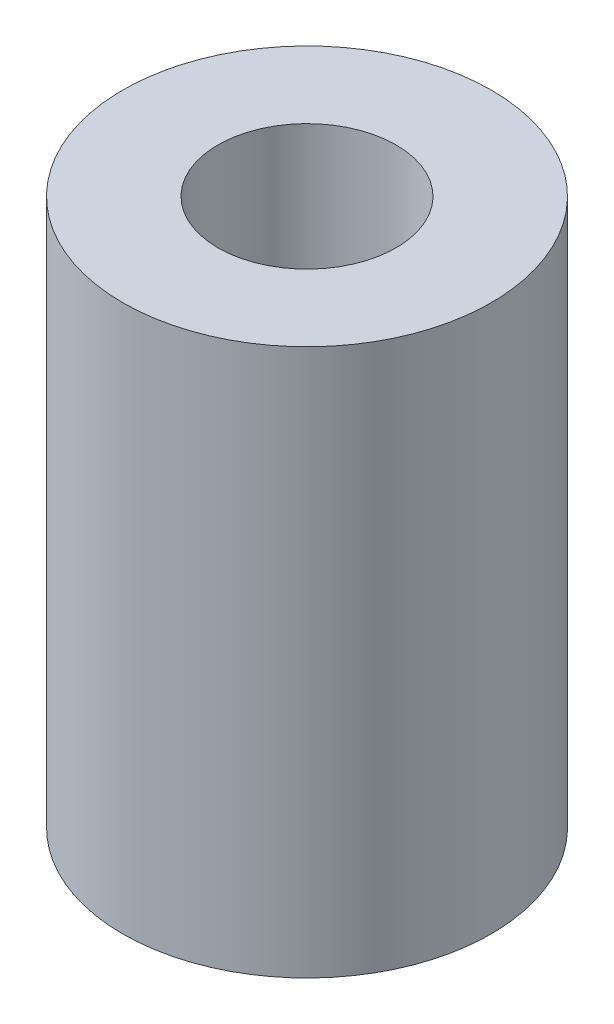
ISO-10303-21;
HEADER;
FILE_DESCRIPTION(('STEP AP214'),'2;1');
FILE_NAME('part.step','',(''),(''),'','','');
FILE_SCHEMA(('AUTOMOTIVE_DESIGN { 1 0 10303 214 1 1 1 1 }'));
ENDSEC;
DATA;
#1=APPLICATION_CONTEXT('core data for automotive mechanical design processes');
#2=APPLICATION_PROTOCOL_DEFINITION('international standard','automotive_design',2000,#1);
#3=PRODUCT_CONTEXT('',#1,'mechanical');
#4=PRODUCT('Part','Part','',(#3));
#5=PRODUCT_RELATED_PRODUCT_CATEGORY('part','',(#4));
#6=PRODUCT_DEFINITION_FORMATION('','',#4);
#7=PRODUCT_DEFINITION_CONTEXT('part definition',#1,'design');
#8=PRODUCT_DEFINITION('design','',#6,#7);
#9=PRODUCT_DEFINITION_SHAPE('','',#8);
#10=(LENGTH_UNIT() NAMED_UNIT(*) SI_UNIT(.MILLI.,.METRE.));
#11=(NAMED_UNIT(*) PLANE_ANGLE_UNIT() SI_UNIT($,.RADIAN.));
#12=(NAMED_UNIT(*) SI_UNIT($,.STERADIAN.) SOLID_ANGLE_UNIT());
#13=UNCERTAINTY_MEASURE_WITH_UNIT(LENGTH_MEASURE(1.E-05),#10,'distance_accuracy_value','');
#14=(GEOMETRIC_REPRESENTATION_CONTEXT(3) GLOBAL_UNCERTAINTY_ASSIGNED_CONTEXT((#13)) GLOBAL_UNIT_ASSIGNED_CONTEXT((#10,
#11,#12)) REPRESENTATION_CONTEXT('',''));
#15=CARTESIAN_POINT('',(0.,0.,0.));
#16=DIRECTION('',(0.,0.,1.));
#17=DIRECTION('',(1.,0.,0.));
#18=AXIS2_PLACEMENT_3D('',#15,#16,#17);
#19=CARTESIAN_POINT('',(0.,23.,0.));
#20=DIRECTION('',(0.,1.,0.));
#21=DIRECTION('',(0.,0.,1.));
#22=AXIS2_PLACEMENT_3D('',#19,#20,#21);
#23=PLANE('',#22);
#24=CARTESIAN_POINT('',(0.,23.,0.));
#25=DIRECTION('',(0.,1.,0.));
#26=DIRECTION('',(0.,0.,1.));
#27=AXIS2_PLACEMENT_3D('',#24,#25,#26);
#28=CIRCLE('',#27,7.75);
#29=CARTESIAN_POINT('',(0.,23.,7.75));
#30=VERTEX_POINT('',#29);
#31=EDGE_CURVE('E11',#30,#30,#28,.T.);
#32=ORIENTED_EDGE('',*,*,#31,.T.);
#33=EDGE_LOOP('',(#32));
#34=FACE_BOUND('',#33,.T.);
#35=CARTESIAN_POINT('',(0.,23.,0.));
#36=DIRECTION('',(0.,1.,0.));
#37=DIRECTION('',(0.,0.,1.));
#38=AXIS2_PLACEMENT_3D('',#35,#36,#37);
#39=CIRCLE('',#38,3.75);
#40=CARTESIAN_POINT('',(0.,23.,3.75));
#41=VERTEX_POINT('',#40);
#42=EDGE_CURVE('E56',#41,#41,#39,.T.);
#43=ORIENTED_EDGE('',*,*,#42,.F.);
#44=EDGE_LOOP('',(#43));
#45=FACE_BOUND('',#44,.T.);
#46=ADVANCED_FACE('F43',(#34,#45),#23,.T.);
#47=CARTESIAN_POINT('',(0.,0.,0.));
#48=DIRECTION('',(0.,1.,0.));
#49=DIRECTION('',(0.,0.,1.));
#50=AXIS2_PLACEMENT_3D('',#47,#48,#49);
#51=PLANE('',#50);
#52=CARTESIAN_POINT('',(0.,0.,0.));
#53=DIRECTION('',(0.,1.,0.));
#54=DIRECTION('',(0.,0.,1.));
#55=AXIS2_PLACEMENT_3D('',#52,#53,#54);
#56=CIRCLE('',#55,7.75);
#57=CARTESIAN_POINT('',(0.,0.,7.75));
#58=VERTEX_POINT('',#57);
#59=EDGE_CURVE('E47',#58,#58,#56,.T.);
#60=ORIENTED_EDGE('',*,*,#59,.F.);
#61=EDGE_LOOP('',(#60));
#62=FACE_BOUND('',#61,.T.);
#63=CARTESIAN_POINT('',(0.,0.,0.));
#64=DIRECTION('',(0.,1.,0.));
#65=DIRECTION('',(0.,0.,1.));
#66=AXIS2_PLACEMENT_3D('',#63,#64,#65);
#67=CIRCLE('',#66,3.75);
#68=CARTESIAN_POINT('',(0.,0.,3.75));
#69=VERTEX_POINT('',#68);
#70=EDGE_CURVE('E58',#69,#69,#67,.T.);
#71=ORIENTED_EDGE('',*,*,#70,.T.);
#72=EDGE_LOOP('',(#71));
#73=FACE_BOUND('',#72,.T.);
#74=ADVANCED_FACE('F70',(#62,#73),#51,.F.);
#75=CARTESIAN_POINT('',(0.,23.,0.));
#76=DIRECTION('',(0.,-1.,0.));
#77=DIRECTION('',(0.,0.,-1.));
#78=AXIS2_PLACEMENT_3D('',#75,#76,#77);
#79=CYLINDRICAL_SURFACE('',#78,7.75);
#80=ORIENTED_EDGE('',*,*,#31,.F.);
#81=EDGE_LOOP('',(#80));
#82=FACE_BOUND('',#81,.T.);
#83=ORIENTED_EDGE('',*,*,#59,.T.);
#84=EDGE_LOOP('',(#83));
#85=FACE_BOUND('',#84,.T.);
#86=ADVANCED_FACE('F45',(#82,#85),#79,.T.);
#87=CARTESIAN_POINT('',(0.,23.,0.));
#88=DIRECTION('',(0.,-1.,0.));
#89=DIRECTION('',(0.,0.,-1.));
#90=AXIS2_PLACEMENT_3D('',#87,#88,#89);
#91=CYLINDRICAL_SURFACE('',#90,3.75);
#92=ORIENTED_EDGE('',*,*,#42,.T.);
#93=EDGE_LOOP('',(#92));
#94=FACE_BOUND('',#93,.T.);
#95=ORIENTED_EDGE('',*,*,#70,.F.);
#96=EDGE_LOOP('',(#95));
#97=FACE_BOUND('',#96,.T.);
#98=ADVANCED_FACE('F66',(#94,#97),#91,.F.);
#99=CLOSED_SHELL('',(#46,#74,#86,#98));
#100=MANIFOLD_SOLID_BREP('B2',#99);
#101=ADVANCED_BREP_SHAPE_REPRESENTATION('',(#18,#100),#14);
#102=SHAPE_DEFINITION_REPRESENTATION(#9,#101);
ENDSEC;
END-ISO-10303-21;
